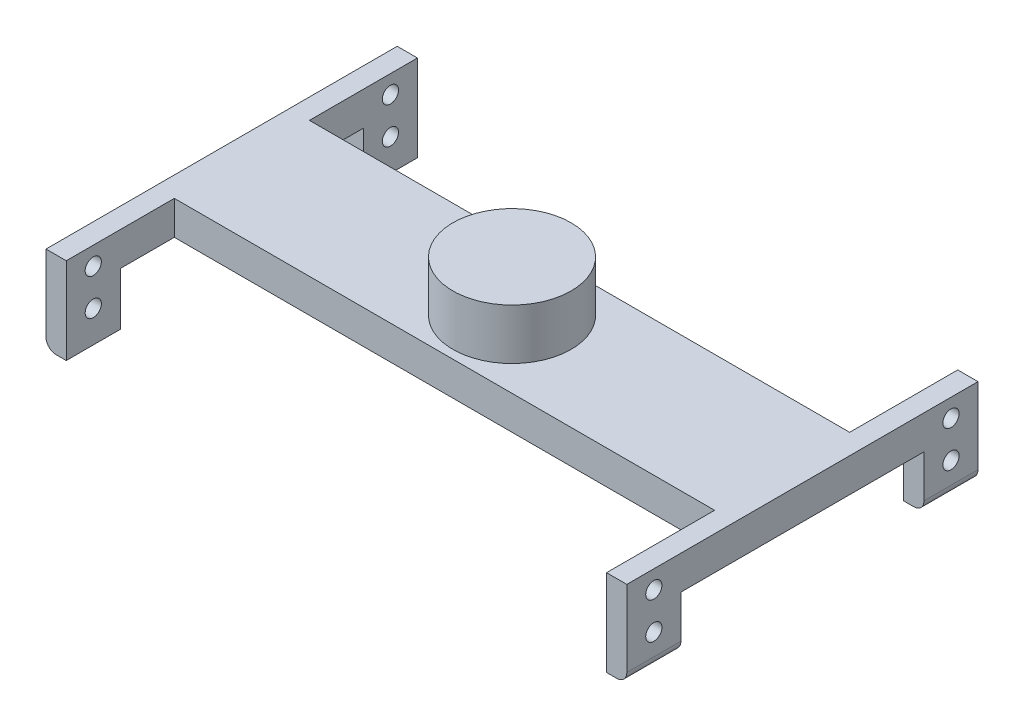
ISO-10303-21;
HEADER;
FILE_DESCRIPTION(('STEP AP214'),'2;1');
FILE_NAME('part.step','',(''),(''),'','','');
FILE_SCHEMA(('AUTOMOTIVE_DESIGN { 1 0 10303 214 1 1 1 1 }'));
ENDSEC;
DATA;
#1=APPLICATION_CONTEXT('core data for automotive mechanical design processes');
#2=APPLICATION_PROTOCOL_DEFINITION('international standard','automotive_design',2000,#1);
#3=PRODUCT_CONTEXT('',#1,'mechanical');
#4=PRODUCT('Part','Part','',(#3));
#5=PRODUCT_RELATED_PRODUCT_CATEGORY('part','',(#4));
#6=PRODUCT_DEFINITION_FORMATION('','',#4);
#7=PRODUCT_DEFINITION_CONTEXT('part definition',#1,'design');
#8=PRODUCT_DEFINITION('design','',#6,#7);
#9=PRODUCT_DEFINITION_SHAPE('','',#8);
#10=(LENGTH_UNIT() NAMED_UNIT(*) SI_UNIT(.MILLI.,.METRE.));
#11=(NAMED_UNIT(*) PLANE_ANGLE_UNIT() SI_UNIT($,.RADIAN.));
#12=(NAMED_UNIT(*) SI_UNIT($,.STERADIAN.) SOLID_ANGLE_UNIT());
#13=UNCERTAINTY_MEASURE_WITH_UNIT(LENGTH_MEASURE(1.E-05),#10,'distance_accuracy_value','');
#14=(GEOMETRIC_REPRESENTATION_CONTEXT(3) GLOBAL_UNCERTAINTY_ASSIGNED_CONTEXT((#13)) GLOBAL_UNIT_ASSIGNED_CONTEXT((#10,
#11,#12)) REPRESENTATION_CONTEXT('',''));
#15=CARTESIAN_POINT('',(0.,0.,0.));
#16=DIRECTION('',(0.,0.,1.));
#17=DIRECTION('',(1.,0.,0.));
#18=AXIS2_PLACEMENT_3D('',#15,#16,#17);
#19=CARTESIAN_POINT('',(-40.,-2.5,10.));
#20=DIRECTION('',(0.,0.,1.));
#21=DIRECTION('',(1.,0.,0.));
#22=AXIS2_PLACEMENT_3D('',#19,#20,#21);
#23=PLANE('',#22);
#24=DIRECTION('',(0.,1.,0.));
#25=VECTOR('',#24,1.);
#26=CARTESIAN_POINT('',(40.,-2.5,10.));
#27=LINE('',#26,#25);
#28=CARTESIAN_POINT('',(40.,-2.5,10.));
#29=VERTEX_POINT('',#28);
#30=CARTESIAN_POINT('',(40.,2.5,10.));
#31=VERTEX_POINT('',#30);
#32=EDGE_CURVE('E341',#29,#31,#27,.T.);
#33=ORIENTED_EDGE('',*,*,#32,.T.);
#34=DIRECTION('',(1.,0.,0.));
#35=VECTOR('',#34,1.);
#36=CARTESIAN_POINT('',(-40.,2.5,10.));
#37=LINE('',#36,#35);
#38=CARTESIAN_POINT('',(-40.,2.49999999999998,10.));
#39=VERTEX_POINT('',#38);
#40=EDGE_CURVE('E331',#39,#31,#37,.T.);
#41=ORIENTED_EDGE('',*,*,#40,.F.);
#42=DIRECTION('',(0.,1.,0.));
#43=VECTOR('',#42,1.);
#44=CARTESIAN_POINT('',(-40.,-2.5,10.));
#45=LINE('',#44,#43);
#46=CARTESIAN_POINT('',(-40.,-2.5,10.));
#47=VERTEX_POINT('',#46);
#48=EDGE_CURVE('E345',#47,#39,#45,.T.);
#49=ORIENTED_EDGE('',*,*,#48,.F.);
#50=DIRECTION('',(1.,0.,0.));
#51=VECTOR('',#50,1.);
#52=CARTESIAN_POINT('',(-40.,-2.5,10.));
#53=LINE('',#52,#51);
#54=EDGE_CURVE('E337',#47,#29,#53,.T.);
#55=ORIENTED_EDGE('',*,*,#54,.T.);
#56=EDGE_LOOP('',(#33,#41,#49,#55));
#57=FACE_BOUND('',#56,.T.);
#58=ADVANCED_FACE('F33',(#57),#23,.T.);
#59=CARTESIAN_POINT('',(-40.,-2.5,-10.));
#60=DIRECTION('',(0.,0.,-1.));
#61=DIRECTION('',(-1.,0.,0.));
#62=AXIS2_PLACEMENT_3D('',#59,#60,#61);
#63=PLANE('',#62);
#64=DIRECTION('',(0.,1.,0.));
#65=VECTOR('',#64,1.);
#66=CARTESIAN_POINT('',(-40.,-2.5,-10.));
#67=LINE('',#66,#65);
#68=CARTESIAN_POINT('',(-40.,-2.5,-10.));
#69=VERTEX_POINT('',#68);
#70=CARTESIAN_POINT('',(-40.,2.5,-10.));
#71=VERTEX_POINT('',#70);
#72=EDGE_CURVE('E347',#69,#71,#67,.T.);
#73=ORIENTED_EDGE('',*,*,#72,.T.);
#74=DIRECTION('',(-1.,0.,0.));
#75=VECTOR('',#74,1.);
#76=CARTESIAN_POINT('',(-40.,2.5,-10.));
#77=LINE('',#76,#75);
#78=CARTESIAN_POINT('',(40.,2.49999999999998,-10.));
#79=VERTEX_POINT('',#78);
#80=EDGE_CURVE('E328',#79,#71,#77,.T.);
#81=ORIENTED_EDGE('',*,*,#80,.F.);
#82=DIRECTION('',(0.,1.,0.));
#83=VECTOR('',#82,1.);
#84=CARTESIAN_POINT('',(40.,-2.5,-10.));
#85=LINE('',#84,#83);
#86=CARTESIAN_POINT('',(40.,-2.5,-10.));
#87=VERTEX_POINT('',#86);
#88=EDGE_CURVE('E340',#87,#79,#85,.T.);
#89=ORIENTED_EDGE('',*,*,#88,.F.);
#90=DIRECTION('',(-1.,0.,0.));
#91=VECTOR('',#90,1.);
#92=CARTESIAN_POINT('',(-40.,-2.5,-10.));
#93=LINE('',#92,#91);
#94=EDGE_CURVE('E334',#87,#69,#93,.T.);
#95=ORIENTED_EDGE('',*,*,#94,.T.);
#96=EDGE_LOOP('',(#73,#81,#89,#95));
#97=FACE_BOUND('',#96,.T.);
#98=ADVANCED_FACE('F492',(#97),#63,.T.);
#99=CARTESIAN_POINT('',(0.,-2.5,0.));
#100=DIRECTION('',(0.,-1.,0.));
#101=DIRECTION('',(0.,0.,-1.));
#102=AXIS2_PLACEMENT_3D('',#99,#100,#101);
#103=PLANE('',#102);
#104=ORIENTED_EDGE('',*,*,#94,.F.);
#105=DIRECTION('',(0.,0.,-1.));
#106=VECTOR('',#105,1.);
#107=CARTESIAN_POINT('',(40.,-2.5,-18.));
#108=LINE('',#107,#106);
#109=CARTESIAN_POINT('',(40.,-2.5,-18.));
#110=VERTEX_POINT('',#109);
#111=EDGE_CURVE('E300',#87,#110,#108,.T.);
#112=ORIENTED_EDGE('',*,*,#111,.T.);
#113=DIRECTION('',(-1.,0.,0.));
#114=VECTOR('',#113,1.);
#115=CARTESIAN_POINT('',(43.,-2.5,-18.));
#116=LINE('',#115,#114);
#117=CARTESIAN_POINT('',(43.,-2.5,-18.));
#118=VERTEX_POINT('',#117);
#119=EDGE_CURVE('E312',#118,#110,#116,.T.);
#120=ORIENTED_EDGE('',*,*,#119,.F.);
#121=DIRECTION('',(0.,0.,-1.));
#122=VECTOR('',#121,1.);
#123=CARTESIAN_POINT('',(43.,-2.5,-18.));
#124=LINE('',#123,#122);
#125=CARTESIAN_POINT('',(43.,-2.5,18.));
#126=VERTEX_POINT('',#125);
#127=EDGE_CURVE('E280',#126,#118,#124,.T.);
#128=ORIENTED_EDGE('',*,*,#127,.F.);
#129=DIRECTION('',(-1.,0.,0.));
#130=VECTOR('',#129,1.);
#131=CARTESIAN_POINT('',(43.,-2.5,18.));
#132=LINE('',#131,#130);
#133=CARTESIAN_POINT('',(40.,-2.5,18.));
#134=VERTEX_POINT('',#133);
#135=EDGE_CURVE('E315',#126,#134,#132,.T.);
#136=ORIENTED_EDGE('',*,*,#135,.T.);
#137=EDGE_CURVE('E301',#134,#29,#108,.T.);
#138=ORIENTED_EDGE('',*,*,#137,.T.);
#139=ORIENTED_EDGE('',*,*,#54,.F.);
#140=DIRECTION('',(0.,0.,-1.));
#141=VECTOR('',#140,1.);
#142=CARTESIAN_POINT('',(-40.,-2.5,-18.));
#143=LINE('',#142,#141);
#144=CARTESIAN_POINT('',(-40.,-2.5,18.));
#145=VERTEX_POINT('',#144);
#146=EDGE_CURVE('E243',#145,#47,#143,.T.);
#147=ORIENTED_EDGE('',*,*,#146,.F.);
#148=DIRECTION('',(1.,0.,0.));
#149=VECTOR('',#148,1.);
#150=CARTESIAN_POINT('',(-43.,-2.5,18.));
#151=LINE('',#150,#149);
#152=CARTESIAN_POINT('',(-43.,-2.5,18.));
#153=VERTEX_POINT('',#152);
#154=EDGE_CURVE('E206',#153,#145,#151,.T.);
#155=ORIENTED_EDGE('',*,*,#154,.F.);
#156=DIRECTION('',(0.,0.,-1.));
#157=VECTOR('',#156,1.);
#158=CARTESIAN_POINT('',(-43.,-2.5,-18.));
#159=LINE('',#158,#157);
#160=CARTESIAN_POINT('',(-43.,-2.5,-18.));
#161=VERTEX_POINT('',#160);
#162=EDGE_CURVE('E212',#153,#161,#159,.T.);
#163=ORIENTED_EDGE('',*,*,#162,.T.);
#164=DIRECTION('',(1.,0.,0.));
#165=VECTOR('',#164,1.);
#166=CARTESIAN_POINT('',(-43.,-2.5,-18.));
#167=LINE('',#166,#165);
#168=CARTESIAN_POINT('',(-40.,-2.5,-18.));
#169=VERTEX_POINT('',#168);
#170=EDGE_CURVE('E195',#161,#169,#167,.T.);
#171=ORIENTED_EDGE('',*,*,#170,.T.);
#172=EDGE_CURVE('E242',#69,#169,#143,.T.);
#173=ORIENTED_EDGE('',*,*,#172,.F.);
#174=EDGE_LOOP('',(#104,#112,#120,#128,#136,#138,#139,#147,#155,#163,#171,#173));
#175=FACE_BOUND('',#174,.T.);
#176=ADVANCED_FACE('F220',(#175),#103,.T.);
#177=CARTESIAN_POINT('',(0.,2.5,0.));
#178=DIRECTION('',(0.,-1.,0.));
#179=DIRECTION('',(0.,0.,-1.));
#180=AXIS2_PLACEMENT_3D('',#177,#178,#179);
#181=PLANE('',#180);
#182=CARTESIAN_POINT('',(0.,2.5,0.));
#183=DIRECTION('',(0.,-1.,0.));
#184=DIRECTION('',(0.,0.,-1.));
#185=AXIS2_PLACEMENT_3D('',#182,#183,#184);
#186=CIRCLE('',#185,8.75);
#187=CARTESIAN_POINT('',(0.,2.5,-8.75));
#188=VERTEX_POINT('',#187);
#189=EDGE_CURVE('E571',#188,#188,#186,.T.);
#190=ORIENTED_EDGE('',*,*,#189,.T.);
#191=EDGE_LOOP('',(#190));
#192=FACE_BOUND('',#191,.T.);
#193=ORIENTED_EDGE('',*,*,#40,.T.);
#194=DIRECTION('',(0.,0.,1.));
#195=VECTOR('',#194,1.);
#196=CARTESIAN_POINT('',(40.,2.49999999999998,26.));
#197=LINE('',#196,#195);
#198=CARTESIAN_POINT('',(40.,2.49999999999998,26.));
#199=VERTEX_POINT('',#198);
#200=EDGE_CURVE('E288',#31,#199,#197,.T.);
#201=ORIENTED_EDGE('',*,*,#200,.T.);
#202=DIRECTION('',(-1.,0.,0.));
#203=VECTOR('',#202,1.);
#204=CARTESIAN_POINT('',(43.,2.49999999999998,26.));
#205=LINE('',#204,#203);
#206=CARTESIAN_POINT('',(43.,2.49999999999998,26.));
#207=VERTEX_POINT('',#206);
#208=EDGE_CURVE('E322',#207,#199,#205,.T.);
#209=ORIENTED_EDGE('',*,*,#208,.F.);
#210=DIRECTION('',(0.,0.,1.));
#211=VECTOR('',#210,1.);
#212=CARTESIAN_POINT('',(43.,2.49999999999998,26.));
#213=LINE('',#212,#211);
#214=CARTESIAN_POINT('',(43.,2.49999999999999,-26.));
#215=VERTEX_POINT('',#214);
#216=EDGE_CURVE('E272',#215,#207,#213,.T.);
#217=ORIENTED_EDGE('',*,*,#216,.F.);
#218=DIRECTION('',(-1.,0.,0.));
#219=VECTOR('',#218,1.);
#220=CARTESIAN_POINT('',(43.,2.49999999999999,-26.));
#221=LINE('',#220,#219);
#222=CARTESIAN_POINT('',(40.,2.49999999999999,-26.));
#223=VERTEX_POINT('',#222);
#224=EDGE_CURVE('E325',#215,#223,#221,.T.);
#225=ORIENTED_EDGE('',*,*,#224,.T.);
#226=EDGE_CURVE('E289',#223,#79,#197,.T.);
#227=ORIENTED_EDGE('',*,*,#226,.T.);
#228=ORIENTED_EDGE('',*,*,#80,.T.);
#229=DIRECTION('',(0.,0.,1.));
#230=VECTOR('',#229,1.);
#231=CARTESIAN_POINT('',(-40.,2.49999999999998,26.));
#232=LINE('',#231,#230);
#233=CARTESIAN_POINT('',(-40.,2.49999999999999,-26.));
#234=VERTEX_POINT('',#233);
#235=EDGE_CURVE('E255',#234,#71,#232,.T.);
#236=ORIENTED_EDGE('',*,*,#235,.F.);
#237=DIRECTION('',(1.,0.,0.));
#238=VECTOR('',#237,1.);
#239=CARTESIAN_POINT('',(-43.,2.49999999999999,-26.));
#240=LINE('',#239,#238);
#241=CARTESIAN_POINT('',(-43.,2.49999999999999,-26.));
#242=VERTEX_POINT('',#241);
#243=EDGE_CURVE('E233',#242,#234,#240,.T.);
#244=ORIENTED_EDGE('',*,*,#243,.F.);
#245=DIRECTION('',(0.,0.,1.));
#246=VECTOR('',#245,1.);
#247=CARTESIAN_POINT('',(-43.,2.49999999999998,26.));
#248=LINE('',#247,#246);
#249=CARTESIAN_POINT('',(-43.,2.49999999999998,26.));
#250=VERTEX_POINT('',#249);
#251=EDGE_CURVE('E230',#242,#250,#248,.T.);
#252=ORIENTED_EDGE('',*,*,#251,.T.);
#253=DIRECTION('',(1.,0.,0.));
#254=VECTOR('',#253,1.);
#255=CARTESIAN_POINT('',(-43.,2.49999999999998,26.));
#256=LINE('',#255,#254);
#257=CARTESIAN_POINT('',(-40.,2.49999999999998,26.));
#258=VERTEX_POINT('',#257);
#259=EDGE_CURVE('E258',#250,#258,#256,.T.);
#260=ORIENTED_EDGE('',*,*,#259,.T.);
#261=EDGE_CURVE('E254',#39,#258,#232,.T.);
#262=ORIENTED_EDGE('',*,*,#261,.F.);
#263=EDGE_LOOP('',(#193,#201,#209,#217,#225,#227,#228,#236,#244,#252,#260,#262));
#264=FACE_BOUND('',#263,.T.);
#265=ADVANCED_FACE('F433',(#192,#264),#181,.F.);
#266=CARTESIAN_POINT('',(40.,0.,0.));
#267=DIRECTION('',(-1.,0.,0.));
#268=DIRECTION('',(0.,0.,1.));
#269=AXIS2_PLACEMENT_3D('',#266,#267,#268);
#270=PLANE('',#269);
#271=CARTESIAN_POINT('',(40.,-5.60000000000002,22.));
#272=DIRECTION('',(-1.,0.,0.));
#273=DIRECTION('',(0.,0.,1.));
#274=AXIS2_PLACEMENT_3D('',#271,#272,#273);
#275=CIRCLE('',#274,1.2);
#276=CARTESIAN_POINT('',(40.,-5.60000000000002,23.2));
#277=VERTEX_POINT('',#276);
#278=EDGE_CURVE('E406',#277,#277,#275,.T.);
#279=ORIENTED_EDGE('',*,*,#278,.F.);
#280=EDGE_LOOP('',(#279));
#281=FACE_BOUND('',#280,.T.);
#282=CARTESIAN_POINT('',(40.,-0.200000000000023,22.));
#283=DIRECTION('',(-1.,0.,0.));
#284=DIRECTION('',(0.,0.,1.));
#285=AXIS2_PLACEMENT_3D('',#282,#283,#284);
#286=CIRCLE('',#285,1.2);
#287=CARTESIAN_POINT('',(40.,-0.200000000000023,23.2));
#288=VERTEX_POINT('',#287);
#289=EDGE_CURVE('E387',#288,#288,#286,.T.);
#290=ORIENTED_EDGE('',*,*,#289,.F.);
#291=EDGE_LOOP('',(#290));
#292=FACE_BOUND('',#291,.T.);
#293=ORIENTED_EDGE('',*,*,#32,.F.);
#294=ORIENTED_EDGE('',*,*,#137,.F.);
#295=DIRECTION('',(0.,1.,0.));
#296=VECTOR('',#295,1.);
#297=CARTESIAN_POINT('',(40.,-10.3,18.));
#298=LINE('',#297,#296);
#299=CARTESIAN_POINT('',(40.,-10.3,18.));
#300=VERTEX_POINT('',#299);
#301=EDGE_CURVE('E298',#300,#134,#298,.T.);
#302=ORIENTED_EDGE('',*,*,#301,.F.);
#303=DIRECTION('',(0.,0.,-1.));
#304=VECTOR('',#303,1.);
#305=CARTESIAN_POINT('',(40.,-10.3,26.));
#306=LINE('',#305,#304);
#307=CARTESIAN_POINT('',(40.,-10.3,26.));
#308=VERTEX_POINT('',#307);
#309=EDGE_CURVE('E295',#308,#300,#306,.T.);
#310=ORIENTED_EDGE('',*,*,#309,.F.);
#311=DIRECTION('',(0.,-1.,0.));
#312=VECTOR('',#311,1.);
#313=CARTESIAN_POINT('',(40.,2.49999999999998,26.));
#314=LINE('',#313,#312);
#315=EDGE_CURVE('E292',#199,#308,#314,.T.);
#316=ORIENTED_EDGE('',*,*,#315,.F.);
#317=ORIENTED_EDGE('',*,*,#200,.F.);
#318=EDGE_LOOP('',(#293,#294,#302,#310,#316,#317));
#319=FACE_BOUND('',#318,.T.);
#320=ADVANCED_FACE('F460',(#281,#292,#319),#270,.T.);
#321=CARTESIAN_POINT('',(43.,2.49999999999999,-26.));
#322=DIRECTION('',(0.,0.,1.));
#323=DIRECTION('',(0.,-1.,0.));
#324=AXIS2_PLACEMENT_3D('',#321,#322,#323);
#325=PLANE('',#324);
#326=DIRECTION('',(0.,1.,0.));
#327=VECTOR('',#326,1.);
#328=CARTESIAN_POINT('',(43.,2.49999999999999,-26.));
#329=LINE('',#328,#327);
#330=CARTESIAN_POINT('',(43.,-8.80000000000001,-26.));
#331=VERTEX_POINT('',#330);
#332=EDGE_CURVE('E270',#331,#215,#329,.T.);
#333=ORIENTED_EDGE('',*,*,#332,.F.);
#334=CARTESIAN_POINT('',(41.5,-8.80000000000001,-26.));
#335=DIRECTION('',(0.,0.,1.));
#336=DIRECTION('',(0.,-1.,0.));
#337=AXIS2_PLACEMENT_3D('',#334,#335,#336);
#338=CIRCLE('',#337,1.5);
#339=CARTESIAN_POINT('',(41.5,-10.3,-26.));
#340=VERTEX_POINT('',#339);
#341=EDGE_CURVE('E57',#331,#340,#338,.F.);
#342=ORIENTED_EDGE('',*,*,#341,.T.);
#343=DIRECTION('',(-1.,0.,0.));
#344=VECTOR('',#343,1.);
#345=CARTESIAN_POINT('',(43.,-10.3,-26.));
#346=LINE('',#345,#344);
#347=CARTESIAN_POINT('',(40.,-10.3,-26.));
#348=VERTEX_POINT('',#347);
#349=EDGE_CURVE('E285',#340,#348,#346,.T.);
#350=ORIENTED_EDGE('',*,*,#349,.T.);
#351=DIRECTION('',(0.,1.,0.));
#352=VECTOR('',#351,1.);
#353=CARTESIAN_POINT('',(40.,2.49999999999999,-26.));
#354=LINE('',#353,#352);
#355=EDGE_CURVE('E269',#348,#223,#354,.T.);
#356=ORIENTED_EDGE('',*,*,#355,.T.);
#357=ORIENTED_EDGE('',*,*,#224,.F.);
#358=EDGE_LOOP('',(#333,#342,#350,#356,#357));
#359=FACE_BOUND('',#358,.T.);
#360=ADVANCED_FACE('F483',(#359),#325,.F.);
#361=CARTESIAN_POINT('',(43.,2.49999999999998,26.));
#362=DIRECTION('',(0.,0.,-1.));
#363=DIRECTION('',(0.,1.,0.));
#364=AXIS2_PLACEMENT_3D('',#361,#362,#363);
#365=PLANE('',#364);
#366=DIRECTION('',(-1.,0.,0.));
#367=VECTOR('',#366,1.);
#368=CARTESIAN_POINT('',(43.,-10.3,26.));
#369=LINE('',#368,#367);
#370=CARTESIAN_POINT('',(41.5,-10.3,26.));
#371=VERTEX_POINT('',#370);
#372=EDGE_CURVE('E320',#371,#308,#369,.T.);
#373=ORIENTED_EDGE('',*,*,#372,.F.);
#374=CARTESIAN_POINT('',(41.5,-8.80000000000002,26.));
#375=DIRECTION('',(0.,0.,-1.));
#376=DIRECTION('',(0.,1.,0.));
#377=AXIS2_PLACEMENT_3D('',#374,#375,#376);
#378=CIRCLE('',#377,1.5);
#379=CARTESIAN_POINT('',(43.,-8.80000000000002,26.));
#380=VERTEX_POINT('',#379);
#381=EDGE_CURVE('E377',#371,#380,#378,.F.);
#382=ORIENTED_EDGE('',*,*,#381,.T.);
#383=DIRECTION('',(0.,-1.,0.));
#384=VECTOR('',#383,1.);
#385=CARTESIAN_POINT('',(43.,2.49999999999998,26.));
#386=LINE('',#385,#384);
#387=EDGE_CURVE('E275',#207,#380,#386,.T.);
#388=ORIENTED_EDGE('',*,*,#387,.F.);
#389=ORIENTED_EDGE('',*,*,#208,.T.);
#390=ORIENTED_EDGE('',*,*,#315,.T.);
#391=EDGE_LOOP('',(#373,#382,#388,#389,#390));
#392=FACE_BOUND('',#391,.T.);
#393=ADVANCED_FACE('F477',(#392),#365,.F.);
#394=CARTESIAN_POINT('',(43.,-10.3,26.));
#395=DIRECTION('',(0.,1.,0.));
#396=DIRECTION('',(0.,0.,1.));
#397=AXIS2_PLACEMENT_3D('',#394,#395,#396);
#398=PLANE('',#397);
#399=DIRECTION('',(-1.,0.,0.));
#400=VECTOR('',#399,1.);
#401=CARTESIAN_POINT('',(43.,-10.3,18.));
#402=LINE('',#401,#400);
#403=CARTESIAN_POINT('',(41.5,-10.3,18.));
#404=VERTEX_POINT('',#403);
#405=EDGE_CURVE('E318',#404,#300,#402,.T.);
#406=ORIENTED_EDGE('',*,*,#405,.F.);
#407=DIRECTION('',(0.,0.,-1.));
#408=VECTOR('',#407,1.);
#409=CARTESIAN_POINT('',(41.5,-10.3,26.));
#410=LINE('',#409,#408);
#411=EDGE_CURVE('E375',#404,#371,#410,.F.);
#412=ORIENTED_EDGE('',*,*,#411,.T.);
#413=ORIENTED_EDGE('',*,*,#372,.T.);
#414=ORIENTED_EDGE('',*,*,#309,.T.);
#415=EDGE_LOOP('',(#406,#412,#413,#414));
#416=FACE_BOUND('',#415,.T.);
#417=ADVANCED_FACE('F472',(#416),#398,.F.);
#418=CARTESIAN_POINT('',(43.,-10.3,18.));
#419=DIRECTION('',(0.,0.,1.));
#420=DIRECTION('',(1.,0.,0.));
#421=AXIS2_PLACEMENT_3D('',#418,#419,#420);
#422=PLANE('',#421);
#423=DIRECTION('',(0.,1.,0.));
#424=VECTOR('',#423,1.);
#425=CARTESIAN_POINT('',(43.,-10.3,18.));
#426=LINE('',#425,#424);
#427=CARTESIAN_POINT('',(43.,-8.80000000000002,18.));
#428=VERTEX_POINT('',#427);
#429=EDGE_CURVE('E278',#428,#126,#426,.T.);
#430=ORIENTED_EDGE('',*,*,#429,.F.);
#431=CARTESIAN_POINT('',(41.5,-8.80000000000002,18.));
#432=DIRECTION('',(0.,0.,1.));
#433=DIRECTION('',(1.,0.,0.));
#434=AXIS2_PLACEMENT_3D('',#431,#432,#433);
#435=CIRCLE('',#434,1.5);
#436=EDGE_CURVE('E373',#428,#404,#435,.F.);
#437=ORIENTED_EDGE('',*,*,#436,.T.);
#438=ORIENTED_EDGE('',*,*,#405,.T.);
#439=ORIENTED_EDGE('',*,*,#301,.T.);
#440=ORIENTED_EDGE('',*,*,#135,.F.);
#441=EDGE_LOOP('',(#430,#437,#438,#439,#440));
#442=FACE_BOUND('',#441,.T.);
#443=ADVANCED_FACE('F468',(#442),#422,.F.);
#444=CARTESIAN_POINT('',(43.,-10.3,-18.));
#445=DIRECTION('',(0.,0.,-1.));
#446=DIRECTION('',(-1.,0.,0.));
#447=AXIS2_PLACEMENT_3D('',#444,#445,#446);
#448=PLANE('',#447);
#449=DIRECTION('',(-1.,0.,0.));
#450=VECTOR('',#449,1.);
#451=CARTESIAN_POINT('',(43.,-10.3,-18.));
#452=LINE('',#451,#450);
#453=CARTESIAN_POINT('',(41.5,-10.3,-18.));
#454=VERTEX_POINT('',#453);
#455=CARTESIAN_POINT('',(40.,-10.3,-18.));
#456=VERTEX_POINT('',#455);
#457=EDGE_CURVE('E310',#454,#456,#452,.T.);
#458=ORIENTED_EDGE('',*,*,#457,.F.);
#459=CARTESIAN_POINT('',(41.5,-8.80000000000001,-18.));
#460=DIRECTION('',(0.,0.,-1.));
#461=DIRECTION('',(-1.,0.,0.));
#462=AXIS2_PLACEMENT_3D('',#459,#460,#461);
#463=CIRCLE('',#462,1.5);
#464=CARTESIAN_POINT('',(43.,-8.80000000000001,-18.));
#465=VERTEX_POINT('',#464);
#466=EDGE_CURVE('E11',#454,#465,#463,.F.);
#467=ORIENTED_EDGE('',*,*,#466,.T.);
#468=DIRECTION('',(0.,-1.,0.));
#469=VECTOR('',#468,1.);
#470=CARTESIAN_POINT('',(43.,-10.3,-18.));
#471=LINE('',#470,#469);
#472=EDGE_CURVE('E282',#118,#465,#471,.T.);
#473=ORIENTED_EDGE('',*,*,#472,.F.);
#474=ORIENTED_EDGE('',*,*,#119,.T.);
#475=DIRECTION('',(0.,-1.,0.));
#476=VECTOR('',#475,1.);
#477=CARTESIAN_POINT('',(40.,-10.3,-18.));
#478=LINE('',#477,#476);
#479=EDGE_CURVE('E304',#110,#456,#478,.T.);
#480=ORIENTED_EDGE('',*,*,#479,.T.);
#481=EDGE_LOOP('',(#458,#467,#473,#474,#480));
#482=FACE_BOUND('',#481,.T.);
#483=ADVANCED_FACE('F497',(#482),#448,.F.);
#484=CARTESIAN_POINT('',(43.,-10.3,-26.));
#485=DIRECTION('',(0.,1.,0.));
#486=DIRECTION('',(0.,0.,1.));
#487=AXIS2_PLACEMENT_3D('',#484,#485,#486);
#488=PLANE('',#487);
#489=ORIENTED_EDGE('',*,*,#349,.F.);
#490=DIRECTION('',(0.,0.,-1.));
#491=VECTOR('',#490,1.);
#492=CARTESIAN_POINT('',(41.5,-10.3,-26.));
#493=LINE('',#492,#491);
#494=EDGE_CURVE('E42',#340,#454,#493,.F.);
#495=ORIENTED_EDGE('',*,*,#494,.T.);
#496=ORIENTED_EDGE('',*,*,#457,.T.);
#497=DIRECTION('',(0.,0.,-1.));
#498=VECTOR('',#497,1.);
#499=CARTESIAN_POINT('',(40.,-10.3,-26.));
#500=LINE('',#499,#498);
#501=EDGE_CURVE('E273',#456,#348,#500,.T.);
#502=ORIENTED_EDGE('',*,*,#501,.T.);
#503=EDGE_LOOP('',(#489,#495,#496,#502));
#504=FACE_BOUND('',#503,.T.);
#505=ADVANCED_FACE('F546',(#504),#488,.F.);
#506=CARTESIAN_POINT('',(43.,0.,0.));
#507=DIRECTION('',(-1.,0.,0.));
#508=DIRECTION('',(0.,0.,1.));
#509=AXIS2_PLACEMENT_3D('',#506,#507,#508);
#510=PLANE('',#509);
#511=CARTESIAN_POINT('',(43.,-5.60000000000002,-22.));
#512=DIRECTION('',(-1.,0.,0.));
#513=DIRECTION('',(0.,0.,1.));
#514=AXIS2_PLACEMENT_3D('',#511,#512,#513);
#515=CIRCLE('',#514,1.2);
#516=CARTESIAN_POINT('',(43.,-5.60000000000002,-20.8));
#517=VERTEX_POINT('',#516);
#518=EDGE_CURVE('E238',#517,#517,#515,.T.);
#519=ORIENTED_EDGE('',*,*,#518,.T.);
#520=EDGE_LOOP('',(#519));
#521=FACE_BOUND('',#520,.T.);
#522=CARTESIAN_POINT('',(43.,-5.60000000000002,22.));
#523=DIRECTION('',(-1.,0.,0.));
#524=DIRECTION('',(0.,0.,1.));
#525=AXIS2_PLACEMENT_3D('',#522,#523,#524);
#526=CIRCLE('',#525,1.2);
#527=CARTESIAN_POINT('',(43.,-5.60000000000002,23.2));
#528=VERTEX_POINT('',#527);
#529=EDGE_CURVE('E403',#528,#528,#526,.T.);
#530=ORIENTED_EDGE('',*,*,#529,.T.);
#531=EDGE_LOOP('',(#530));
#532=FACE_BOUND('',#531,.T.);
#533=CARTESIAN_POINT('',(43.,-0.200000000000023,22.));
#534=DIRECTION('',(-1.,0.,0.));
#535=DIRECTION('',(0.,0.,1.));
#536=AXIS2_PLACEMENT_3D('',#533,#534,#535);
#537=CIRCLE('',#536,1.2);
#538=CARTESIAN_POINT('',(43.,-0.200000000000023,23.2));
#539=VERTEX_POINT('',#538);
#540=EDGE_CURVE('E382',#539,#539,#537,.T.);
#541=ORIENTED_EDGE('',*,*,#540,.T.);
#542=EDGE_LOOP('',(#541));
#543=FACE_BOUND('',#542,.T.);
#544=CARTESIAN_POINT('',(43.,-0.200000000000023,-22.));
#545=DIRECTION('',(-1.,0.,0.));
#546=DIRECTION('',(0.,0.,1.));
#547=AXIS2_PLACEMENT_3D('',#544,#545,#546);
#548=CIRCLE('',#547,1.2);
#549=CARTESIAN_POINT('',(43.,-0.200000000000023,-20.8));
#550=VERTEX_POINT('',#549);
#551=EDGE_CURVE('E415',#550,#550,#548,.T.);
#552=ORIENTED_EDGE('',*,*,#551,.T.);
#553=EDGE_LOOP('',(#552));
#554=FACE_BOUND('',#553,.T.);
#555=ORIENTED_EDGE('',*,*,#387,.T.);
#556=DIRECTION('',(0.,0.,-1.));
#557=VECTOR('',#556,1.);
#558=CARTESIAN_POINT('',(43.,-8.80000000000002,0.));
#559=LINE('',#558,#557);
#560=EDGE_CURVE('E370',#380,#428,#559,.T.);
#561=ORIENTED_EDGE('',*,*,#560,.T.);
#562=ORIENTED_EDGE('',*,*,#429,.T.);
#563=ORIENTED_EDGE('',*,*,#127,.T.);
#564=ORIENTED_EDGE('',*,*,#472,.T.);
#565=DIRECTION('',(0.,0.,-1.));
#566=VECTOR('',#565,1.);
#567=CARTESIAN_POINT('',(43.,-8.80000000000002,0.));
#568=LINE('',#567,#566);
#569=EDGE_CURVE('E367',#465,#331,#568,.T.);
#570=ORIENTED_EDGE('',*,*,#569,.T.);
#571=ORIENTED_EDGE('',*,*,#332,.T.);
#572=ORIENTED_EDGE('',*,*,#216,.T.);
#573=EDGE_LOOP('',(#555,#561,#562,#563,#564,#570,#571,#572));
#574=FACE_BOUND('',#573,.T.);
#575=ADVANCED_FACE('F500',(#521,#532,#543,#554,#574),#510,.F.);
#576=CARTESIAN_POINT('',(40.,-5.60000000000002,-22.));
#577=DIRECTION('',(-1.,0.,0.));
#578=DIRECTION('',(0.,0.,1.));
#579=AXIS2_PLACEMENT_3D('',#576,#577,#578);
#580=CIRCLE('',#579,1.2);
#581=CARTESIAN_POINT('',(40.,-5.60000000000002,-20.8));
#582=VERTEX_POINT('',#581);
#583=EDGE_CURVE('E421',#582,#582,#580,.T.);
#584=ORIENTED_EDGE('',*,*,#583,.F.);
#585=EDGE_LOOP('',(#584));
#586=FACE_BOUND('',#585,.T.);
#587=CARTESIAN_POINT('',(40.,-0.200000000000023,-22.));
#588=DIRECTION('',(-1.,0.,0.));
#589=DIRECTION('',(0.,0.,1.));
#590=AXIS2_PLACEMENT_3D('',#587,#588,#589);
#591=CIRCLE('',#590,1.2);
#592=CARTESIAN_POINT('',(40.,-0.200000000000023,-20.8));
#593=VERTEX_POINT('',#592);
#594=EDGE_CURVE('E412',#593,#593,#591,.T.);
#595=ORIENTED_EDGE('',*,*,#594,.F.);
#596=EDGE_LOOP('',(#595));
#597=FACE_BOUND('',#596,.T.);
#598=ORIENTED_EDGE('',*,*,#111,.F.);
#599=ORIENTED_EDGE('',*,*,#88,.T.);
#600=ORIENTED_EDGE('',*,*,#226,.F.);
#601=ORIENTED_EDGE('',*,*,#355,.F.);
#602=ORIENTED_EDGE('',*,*,#501,.F.);
#603=ORIENTED_EDGE('',*,*,#479,.F.);
#604=EDGE_LOOP('',(#598,#599,#600,#601,#602,#603));
#605=FACE_BOUND('',#604,.T.);
#606=ADVANCED_FACE('F487',(#586,#597,#605),#270,.T.);
#607=CARTESIAN_POINT('',(-40.,0.,0.));
#608=DIRECTION('',(1.,0.,0.));
#609=DIRECTION('',(0.,0.,1.));
#610=AXIS2_PLACEMENT_3D('',#607,#608,#609);
#611=PLANE('',#610);
#612=CARTESIAN_POINT('',(-40.,-5.60000000000002,-22.));
#613=DIRECTION('',(1.,0.,0.));
#614=DIRECTION('',(0.,0.,-1.));
#615=AXIS2_PLACEMENT_3D('',#612,#613,#614);
#616=CIRCLE('',#615,1.2);
#617=CARTESIAN_POINT('',(-40.,-5.60000000000002,-23.2));
#618=VERTEX_POINT('',#617);
#619=EDGE_CURVE('E418',#618,#618,#616,.T.);
#620=ORIENTED_EDGE('',*,*,#619,.F.);
#621=EDGE_LOOP('',(#620));
#622=FACE_BOUND('',#621,.T.);
#623=CARTESIAN_POINT('',(-40.,-0.200000000000023,-22.));
#624=DIRECTION('',(1.,0.,0.));
#625=DIRECTION('',(0.,0.,-1.));
#626=AXIS2_PLACEMENT_3D('',#623,#624,#625);
#627=CIRCLE('',#626,1.2);
#628=CARTESIAN_POINT('',(-40.,-0.200000000000023,-23.2));
#629=VERTEX_POINT('',#628);
#630=EDGE_CURVE('E409',#629,#629,#627,.T.);
#631=ORIENTED_EDGE('',*,*,#630,.F.);
#632=EDGE_LOOP('',(#631));
#633=FACE_BOUND('',#632,.T.);
#634=ORIENTED_EDGE('',*,*,#72,.F.);
#635=ORIENTED_EDGE('',*,*,#172,.T.);
#636=DIRECTION('',(0.,-1.,0.));
#637=VECTOR('',#636,1.);
#638=CARTESIAN_POINT('',(-40.,-10.3,-18.));
#639=LINE('',#638,#637);
#640=CARTESIAN_POINT('',(-40.,-10.3,-18.));
#641=VERTEX_POINT('',#640);
#642=EDGE_CURVE('E201',#169,#641,#639,.T.);
#643=ORIENTED_EDGE('',*,*,#642,.T.);
#644=DIRECTION('',(0.,0.,-1.));
#645=VECTOR('',#644,1.);
#646=CARTESIAN_POINT('',(-40.,-10.3,-26.));
#647=LINE('',#646,#645);
#648=CARTESIAN_POINT('',(-40.,-10.3,-26.));
#649=VERTEX_POINT('',#648);
#650=EDGE_CURVE('E237',#641,#649,#647,.T.);
#651=ORIENTED_EDGE('',*,*,#650,.T.);
#652=DIRECTION('',(0.,1.,0.));
#653=VECTOR('',#652,1.);
#654=CARTESIAN_POINT('',(-40.,2.49999999999999,-26.));
#655=LINE('',#654,#653);
#656=EDGE_CURVE('E234',#649,#234,#655,.T.);
#657=ORIENTED_EDGE('',*,*,#656,.T.);
#658=ORIENTED_EDGE('',*,*,#235,.T.);
#659=EDGE_LOOP('',(#634,#635,#643,#651,#657,#658));
#660=FACE_BOUND('',#659,.T.);
#661=ADVANCED_FACE('F494',(#622,#633,#660),#611,.T.);
#662=CARTESIAN_POINT('',(-43.,2.49999999999999,-26.));
#663=DIRECTION('',(0.,0.,-1.));
#664=DIRECTION('',(0.,1.,0.));
#665=AXIS2_PLACEMENT_3D('',#662,#663,#664);
#666=PLANE('',#665);
#667=DIRECTION('',(1.,0.,0.));
#668=VECTOR('',#667,1.);
#669=CARTESIAN_POINT('',(-43.,-10.3,-26.));
#670=LINE('',#669,#668);
#671=CARTESIAN_POINT('',(-41.5,-10.3,-26.));
#672=VERTEX_POINT('',#671);
#673=EDGE_CURVE('E267',#672,#649,#670,.T.);
#674=ORIENTED_EDGE('',*,*,#673,.F.);
#675=CARTESIAN_POINT('',(-41.5,-8.80000000000001,-26.));
#676=DIRECTION('',(0.,0.,-1.));
#677=DIRECTION('',(0.,1.,0.));
#678=AXIS2_PLACEMENT_3D('',#675,#676,#677);
#679=CIRCLE('',#678,1.5);
#680=CARTESIAN_POINT('',(-43.,-8.80000000000001,-26.));
#681=VERTEX_POINT('',#680);
#682=EDGE_CURVE('E363',#672,#681,#679,.T.);
#683=ORIENTED_EDGE('',*,*,#682,.T.);
#684=DIRECTION('',(0.,1.,0.));
#685=VECTOR('',#684,1.);
#686=CARTESIAN_POINT('',(-43.,2.49999999999999,-26.));
#687=LINE('',#686,#685);
#688=EDGE_CURVE('E216',#681,#242,#687,.T.);
#689=ORIENTED_EDGE('',*,*,#688,.T.);
#690=ORIENTED_EDGE('',*,*,#243,.T.);
#691=ORIENTED_EDGE('',*,*,#656,.F.);
#692=EDGE_LOOP('',(#674,#683,#689,#690,#691));
#693=FACE_BOUND('',#692,.T.);
#694=ADVANCED_FACE('F428',(#693),#666,.T.);
#695=CARTESIAN_POINT('',(-43.,-10.3,-26.));
#696=DIRECTION('',(0.,-1.,0.));
#697=DIRECTION('',(0.,0.,-1.));
#698=AXIS2_PLACEMENT_3D('',#695,#696,#697);
#699=PLANE('',#698);
#700=DIRECTION('',(1.,0.,0.));
#701=VECTOR('',#700,1.);
#702=CARTESIAN_POINT('',(-43.,-10.3,-18.));
#703=LINE('',#702,#701);
#704=CARTESIAN_POINT('',(-41.5,-10.3,-18.));
#705=VERTEX_POINT('',#704);
#706=EDGE_CURVE('E205',#705,#641,#703,.T.);
#707=ORIENTED_EDGE('',*,*,#706,.F.);
#708=DIRECTION('',(0.,0.,-1.));
#709=VECTOR('',#708,1.);
#710=CARTESIAN_POINT('',(-41.5,-10.3,-26.));
#711=LINE('',#710,#709);
#712=EDGE_CURVE('E360',#705,#672,#711,.T.);
#713=ORIENTED_EDGE('',*,*,#712,.T.);
#714=ORIENTED_EDGE('',*,*,#673,.T.);
#715=ORIENTED_EDGE('',*,*,#650,.F.);
#716=EDGE_LOOP('',(#707,#713,#714,#715));
#717=FACE_BOUND('',#716,.T.);
#718=ADVANCED_FACE('F533',(#717),#699,.T.);
#719=CARTESIAN_POINT('',(-43.,-10.3,-18.));
#720=DIRECTION('',(0.,0.,1.));
#721=DIRECTION('',(1.,0.,0.));
#722=AXIS2_PLACEMENT_3D('',#719,#720,#721);
#723=PLANE('',#722);
#724=DIRECTION('',(0.,-1.,0.));
#725=VECTOR('',#724,1.);
#726=CARTESIAN_POINT('',(-43.,-10.3,-18.));
#727=LINE('',#726,#725);
#728=CARTESIAN_POINT('',(-43.,-8.80000000000001,-18.));
#729=VERTEX_POINT('',#728);
#730=EDGE_CURVE('E198',#161,#729,#727,.T.);
#731=ORIENTED_EDGE('',*,*,#730,.T.);
#732=CARTESIAN_POINT('',(-41.5,-8.80000000000001,-18.));
#733=DIRECTION('',(0.,0.,1.));
#734=DIRECTION('',(1.,0.,0.));
#735=AXIS2_PLACEMENT_3D('',#732,#733,#734);
#736=CIRCLE('',#735,1.5);
#737=EDGE_CURVE('E365',#729,#705,#736,.T.);
#738=ORIENTED_EDGE('',*,*,#737,.T.);
#739=ORIENTED_EDGE('',*,*,#706,.T.);
#740=ORIENTED_EDGE('',*,*,#642,.F.);
#741=ORIENTED_EDGE('',*,*,#170,.F.);
#742=EDGE_LOOP('',(#731,#738,#739,#740,#741));
#743=FACE_BOUND('',#742,.T.);
#744=ADVANCED_FACE('F197',(#743),#723,.T.);
#745=CARTESIAN_POINT('',(-43.,-10.3,18.));
#746=DIRECTION('',(0.,0.,-1.));
#747=DIRECTION('',(-1.,0.,0.));
#748=AXIS2_PLACEMENT_3D('',#745,#746,#747);
#749=PLANE('',#748);
#750=DIRECTION('',(1.,0.,0.));
#751=VECTOR('',#750,1.);
#752=CARTESIAN_POINT('',(-43.,-10.3,18.));
#753=LINE('',#752,#751);
#754=CARTESIAN_POINT('',(-41.5,-10.3,18.));
#755=VERTEX_POINT('',#754);
#756=CARTESIAN_POINT('',(-40.,-10.3,18.));
#757=VERTEX_POINT('',#756);
#758=EDGE_CURVE('E263',#755,#757,#753,.T.);
#759=ORIENTED_EDGE('',*,*,#758,.F.);
#760=CARTESIAN_POINT('',(-41.5,-8.80000000000002,18.));
#761=DIRECTION('',(0.,0.,-1.));
#762=DIRECTION('',(-1.,0.,0.));
#763=AXIS2_PLACEMENT_3D('',#760,#761,#762);
#764=CIRCLE('',#763,1.5);
#765=CARTESIAN_POINT('',(-43.,-8.80000000000002,18.));
#766=VERTEX_POINT('',#765);
#767=EDGE_CURVE('E353',#755,#766,#764,.T.);
#768=ORIENTED_EDGE('',*,*,#767,.T.);
#769=DIRECTION('',(0.,1.,0.));
#770=VECTOR('',#769,1.);
#771=CARTESIAN_POINT('',(-43.,-10.3,18.));
#772=LINE('',#771,#770);
#773=EDGE_CURVE('E222',#766,#153,#772,.T.);
#774=ORIENTED_EDGE('',*,*,#773,.T.);
#775=ORIENTED_EDGE('',*,*,#154,.T.);
#776=DIRECTION('',(0.,1.,0.));
#777=VECTOR('',#776,1.);
#778=CARTESIAN_POINT('',(-40.,-10.3,18.));
#779=LINE('',#778,#777);
#780=EDGE_CURVE('E245',#757,#145,#779,.T.);
#781=ORIENTED_EDGE('',*,*,#780,.F.);
#782=EDGE_LOOP('',(#759,#768,#774,#775,#781));
#783=FACE_BOUND('',#782,.T.);
#784=ADVANCED_FACE('F450',(#783),#749,.T.);
#785=CARTESIAN_POINT('',(-43.,-10.3,26.));
#786=DIRECTION('',(0.,-1.,0.));
#787=DIRECTION('',(0.,0.,-1.));
#788=AXIS2_PLACEMENT_3D('',#785,#786,#787);
#789=PLANE('',#788);
#790=DIRECTION('',(1.,0.,0.));
#791=VECTOR('',#790,1.);
#792=CARTESIAN_POINT('',(-43.,-10.3,26.));
#793=LINE('',#792,#791);
#794=CARTESIAN_POINT('',(-41.5,-10.3,26.));
#795=VERTEX_POINT('',#794);
#796=CARTESIAN_POINT('',(-40.,-10.3,26.));
#797=VERTEX_POINT('',#796);
#798=EDGE_CURVE('E261',#795,#797,#793,.T.);
#799=ORIENTED_EDGE('',*,*,#798,.F.);
#800=DIRECTION('',(0.,0.,-1.));
#801=VECTOR('',#800,1.);
#802=CARTESIAN_POINT('',(-41.5,-10.3,18.));
#803=LINE('',#802,#801);
#804=EDGE_CURVE('E344',#795,#755,#803,.T.);
#805=ORIENTED_EDGE('',*,*,#804,.T.);
#806=ORIENTED_EDGE('',*,*,#758,.T.);
#807=DIRECTION('',(0.,0.,-1.));
#808=VECTOR('',#807,1.);
#809=CARTESIAN_POINT('',(-40.,-10.3,26.));
#810=LINE('',#809,#808);
#811=EDGE_CURVE('E248',#797,#757,#810,.T.);
#812=ORIENTED_EDGE('',*,*,#811,.F.);
#813=EDGE_LOOP('',(#799,#805,#806,#812));
#814=FACE_BOUND('',#813,.T.);
#815=ADVANCED_FACE('F446',(#814),#789,.T.);
#816=CARTESIAN_POINT('',(-43.,2.49999999999998,26.));
#817=DIRECTION('',(0.,0.,1.));
#818=DIRECTION('',(0.,-1.,0.));
#819=AXIS2_PLACEMENT_3D('',#816,#817,#818);
#820=PLANE('',#819);
#821=DIRECTION('',(0.,-1.,0.));
#822=VECTOR('',#821,1.);
#823=CARTESIAN_POINT('',(-43.,2.49999999999998,26.));
#824=LINE('',#823,#822);
#825=CARTESIAN_POINT('',(-43.,-8.80000000000002,26.));
#826=VERTEX_POINT('',#825);
#827=EDGE_CURVE('E224',#250,#826,#824,.T.);
#828=ORIENTED_EDGE('',*,*,#827,.T.);
#829=CARTESIAN_POINT('',(-41.5,-8.80000000000002,26.));
#830=DIRECTION('',(0.,0.,1.));
#831=DIRECTION('',(0.,-1.,0.));
#832=AXIS2_PLACEMENT_3D('',#829,#830,#831);
#833=CIRCLE('',#832,1.5);
#834=EDGE_CURVE('E358',#826,#795,#833,.T.);
#835=ORIENTED_EDGE('',*,*,#834,.T.);
#836=ORIENTED_EDGE('',*,*,#798,.T.);
#837=DIRECTION('',(0.,-1.,0.));
#838=VECTOR('',#837,1.);
#839=CARTESIAN_POINT('',(-40.,2.49999999999998,26.));
#840=LINE('',#839,#838);
#841=EDGE_CURVE('E251',#258,#797,#840,.T.);
#842=ORIENTED_EDGE('',*,*,#841,.F.);
#843=ORIENTED_EDGE('',*,*,#259,.F.);
#844=EDGE_LOOP('',(#828,#835,#836,#842,#843));
#845=FACE_BOUND('',#844,.T.);
#846=ADVANCED_FACE('F438',(#845),#820,.T.);
#847=CARTESIAN_POINT('',(-43.,0.,0.));
#848=DIRECTION('',(1.,0.,0.));
#849=DIRECTION('',(0.,0.,1.));
#850=AXIS2_PLACEMENT_3D('',#847,#848,#849);
#851=PLANE('',#850);
#852=CARTESIAN_POINT('',(-43.,-5.60000000000002,-22.));
#853=DIRECTION('',(1.,0.,0.));
#854=DIRECTION('',(0.,0.,-1.));
#855=AXIS2_PLACEMENT_3D('',#852,#853,#854);
#856=CIRCLE('',#855,1.2);
#857=CARTESIAN_POINT('',(-43.,-5.60000000000002,-23.2));
#858=VERTEX_POINT('',#857);
#859=EDGE_CURVE('E398',#858,#858,#856,.T.);
#860=ORIENTED_EDGE('',*,*,#859,.T.);
#861=EDGE_LOOP('',(#860));
#862=FACE_BOUND('',#861,.T.);
#863=CARTESIAN_POINT('',(-43.,-5.60000000000002,22.));
#864=DIRECTION('',(1.,0.,0.));
#865=DIRECTION('',(0.,0.,-1.));
#866=AXIS2_PLACEMENT_3D('',#863,#864,#865);
#867=CIRCLE('',#866,1.2);
#868=CARTESIAN_POINT('',(-43.,-5.60000000000002,20.8));
#869=VERTEX_POINT('',#868);
#870=EDGE_CURVE('E395',#869,#869,#867,.T.);
#871=ORIENTED_EDGE('',*,*,#870,.T.);
#872=EDGE_LOOP('',(#871));
#873=FACE_BOUND('',#872,.T.);
#874=CARTESIAN_POINT('',(-43.,-0.200000000000023,22.));
#875=DIRECTION('',(1.,0.,0.));
#876=DIRECTION('',(0.,0.,-1.));
#877=AXIS2_PLACEMENT_3D('',#874,#875,#876);
#878=CIRCLE('',#877,1.2);
#879=CARTESIAN_POINT('',(-43.,-0.200000000000023,20.8));
#880=VERTEX_POINT('',#879);
#881=EDGE_CURVE('E390',#880,#880,#878,.T.);
#882=ORIENTED_EDGE('',*,*,#881,.T.);
#883=EDGE_LOOP('',(#882));
#884=FACE_BOUND('',#883,.T.);
#885=CARTESIAN_POINT('',(-43.,-0.200000000000023,-22.));
#886=DIRECTION('',(1.,0.,0.));
#887=DIRECTION('',(0.,0.,-1.));
#888=AXIS2_PLACEMENT_3D('',#885,#886,#887);
#889=CIRCLE('',#888,1.2);
#890=CARTESIAN_POINT('',(-43.,-0.200000000000023,-23.2));
#891=VERTEX_POINT('',#890);
#892=EDGE_CURVE('E383',#891,#891,#889,.T.);
#893=ORIENTED_EDGE('',*,*,#892,.T.);
#894=EDGE_LOOP('',(#893));
#895=FACE_BOUND('',#894,.T.);
#896=ORIENTED_EDGE('',*,*,#773,.F.);
#897=DIRECTION('',(0.,0.,-1.));
#898=VECTOR('',#897,1.);
#899=CARTESIAN_POINT('',(-43.,-8.80000000000002,26.));
#900=LINE('',#899,#898);
#901=EDGE_CURVE('E356',#766,#826,#900,.F.);
#902=ORIENTED_EDGE('',*,*,#901,.T.);
#903=ORIENTED_EDGE('',*,*,#827,.F.);
#904=ORIENTED_EDGE('',*,*,#251,.F.);
#905=ORIENTED_EDGE('',*,*,#688,.F.);
#906=DIRECTION('',(0.,0.,-1.));
#907=VECTOR('',#906,1.);
#908=CARTESIAN_POINT('',(-43.,-8.80000000000001,-18.));
#909=LINE('',#908,#907);
#910=EDGE_CURVE('E215',#681,#729,#909,.F.);
#911=ORIENTED_EDGE('',*,*,#910,.T.);
#912=ORIENTED_EDGE('',*,*,#730,.F.);
#913=ORIENTED_EDGE('',*,*,#162,.F.);
#914=EDGE_LOOP('',(#896,#902,#903,#904,#905,#911,#912,#913));
#915=FACE_BOUND('',#914,.T.);
#916=ADVANCED_FACE('F211',(#862,#873,#884,#895,#915),#851,.F.);
#917=CARTESIAN_POINT('',(-40.,-5.60000000000002,22.));
#918=DIRECTION('',(1.,0.,0.));
#919=DIRECTION('',(0.,0.,-1.));
#920=AXIS2_PLACEMENT_3D('',#917,#918,#919);
#921=CIRCLE('',#920,1.2);
#922=CARTESIAN_POINT('',(-40.,-5.60000000000002,20.8));
#923=VERTEX_POINT('',#922);
#924=EDGE_CURVE('E37',#923,#923,#921,.T.);
#925=ORIENTED_EDGE('',*,*,#924,.F.);
#926=EDGE_LOOP('',(#925));
#927=FACE_BOUND('',#926,.T.);
#928=CARTESIAN_POINT('',(-40.,-0.200000000000023,22.));
#929=DIRECTION('',(1.,0.,0.));
#930=DIRECTION('',(0.,0.,-1.));
#931=AXIS2_PLACEMENT_3D('',#928,#929,#930);
#932=CIRCLE('',#931,1.2);
#933=CARTESIAN_POINT('',(-40.,-0.200000000000023,20.8));
#934=VERTEX_POINT('',#933);
#935=EDGE_CURVE('E380',#934,#934,#932,.T.);
#936=ORIENTED_EDGE('',*,*,#935,.F.);
#937=EDGE_LOOP('',(#936));
#938=FACE_BOUND('',#937,.T.);
#939=ORIENTED_EDGE('',*,*,#146,.T.);
#940=ORIENTED_EDGE('',*,*,#48,.T.);
#941=ORIENTED_EDGE('',*,*,#261,.T.);
#942=ORIENTED_EDGE('',*,*,#841,.T.);
#943=ORIENTED_EDGE('',*,*,#811,.T.);
#944=ORIENTED_EDGE('',*,*,#780,.T.);
#945=EDGE_LOOP('',(#939,#940,#941,#942,#943,#944));
#946=FACE_BOUND('',#945,.T.);
#947=ADVANCED_FACE('F452',(#927,#938,#946),#611,.T.);
#948=CARTESIAN_POINT('',(-41.5,-8.80000000000002,26.));
#949=DIRECTION('',(0.,0.,1.));
#950=DIRECTION('',(1.,0.,0.));
#951=AXIS2_PLACEMENT_3D('',#948,#949,#950);
#952=CYLINDRICAL_SURFACE('',#951,1.5);
#953=ORIENTED_EDGE('',*,*,#834,.F.);
#954=ORIENTED_EDGE('',*,*,#901,.F.);
#955=ORIENTED_EDGE('',*,*,#767,.F.);
#956=ORIENTED_EDGE('',*,*,#804,.F.);
#957=EDGE_LOOP('',(#953,#954,#955,#956));
#958=FACE_BOUND('',#957,.T.);
#959=ADVANCED_FACE('F443',(#958),#952,.T.);
#960=CARTESIAN_POINT('',(-41.5,-8.80000000000001,-26.));
#961=DIRECTION('',(0.,0.,1.));
#962=DIRECTION('',(0.,-1.,0.));
#963=AXIS2_PLACEMENT_3D('',#960,#961,#962);
#964=CYLINDRICAL_SURFACE('',#963,1.5);
#965=ORIENTED_EDGE('',*,*,#737,.F.);
#966=ORIENTED_EDGE('',*,*,#910,.F.);
#967=ORIENTED_EDGE('',*,*,#682,.F.);
#968=ORIENTED_EDGE('',*,*,#712,.F.);
#969=EDGE_LOOP('',(#965,#966,#967,#968));
#970=FACE_BOUND('',#969,.T.);
#971=ADVANCED_FACE('F512',(#970),#964,.T.);
#972=CARTESIAN_POINT('',(41.5,-8.80000000000002,0.));
#973=DIRECTION('',(0.,0.,-1.));
#974=DIRECTION('',(-1.,0.,0.));
#975=AXIS2_PLACEMENT_3D('',#972,#973,#974);
#976=CYLINDRICAL_SURFACE('',#975,1.5);
#977=ORIENTED_EDGE('',*,*,#381,.F.);
#978=ORIENTED_EDGE('',*,*,#411,.F.);
#979=ORIENTED_EDGE('',*,*,#436,.F.);
#980=ORIENTED_EDGE('',*,*,#560,.F.);
#981=EDGE_LOOP('',(#977,#978,#979,#980));
#982=FACE_BOUND('',#981,.T.);
#983=ADVANCED_FACE('F504',(#982),#976,.T.);
#984=CARTESIAN_POINT('',(41.5,-8.80000000000002,0.));
#985=DIRECTION('',(0.,0.,-1.));
#986=DIRECTION('',(0.,1.,0.));
#987=AXIS2_PLACEMENT_3D('',#984,#985,#986);
#988=CYLINDRICAL_SURFACE('',#987,1.5);
#989=ORIENTED_EDGE('',*,*,#466,.F.);
#990=ORIENTED_EDGE('',*,*,#494,.F.);
#991=ORIENTED_EDGE('',*,*,#341,.F.);
#992=ORIENTED_EDGE('',*,*,#569,.F.);
#993=EDGE_LOOP('',(#989,#990,#991,#992));
#994=FACE_BOUND('',#993,.T.);
#995=ADVANCED_FACE('F35',(#994),#988,.T.);
#996=CARTESIAN_POINT('',(-43.,-0.200000000000023,22.));
#997=DIRECTION('',(1.,0.,0.));
#998=DIRECTION('',(0.,0.,-1.));
#999=AXIS2_PLACEMENT_3D('',#996,#997,#998);
#1000=CYLINDRICAL_SURFACE('',#999,1.2);
#1001=ORIENTED_EDGE('',*,*,#935,.T.);
#1002=EDGE_LOOP('',(#1001));
#1003=FACE_BOUND('',#1002,.T.);
#1004=ORIENTED_EDGE('',*,*,#881,.F.);
#1005=EDGE_LOOP('',(#1004));
#1006=FACE_BOUND('',#1005,.T.);
#1007=ADVANCED_FACE('F503',(#1003,#1006),#1000,.F.);
#1008=CARTESIAN_POINT('',(-43.,-5.60000000000002,22.));
#1009=DIRECTION('',(1.,0.,0.));
#1010=DIRECTION('',(0.,0.,-1.));
#1011=AXIS2_PLACEMENT_3D('',#1008,#1009,#1010);
#1012=CYLINDRICAL_SURFACE('',#1011,1.2);
#1013=ORIENTED_EDGE('',*,*,#924,.T.);
#1014=EDGE_LOOP('',(#1013));
#1015=FACE_BOUND('',#1014,.T.);
#1016=ORIENTED_EDGE('',*,*,#870,.F.);
#1017=EDGE_LOOP('',(#1016));
#1018=FACE_BOUND('',#1017,.T.);
#1019=ADVANCED_FACE('F509',(#1015,#1018),#1012,.F.);
#1020=CARTESIAN_POINT('',(-43.,-0.200000000000023,-22.));
#1021=DIRECTION('',(1.,0.,0.));
#1022=DIRECTION('',(0.,0.,-1.));
#1023=AXIS2_PLACEMENT_3D('',#1020,#1021,#1022);
#1024=CYLINDRICAL_SURFACE('',#1023,1.2);
#1025=ORIENTED_EDGE('',*,*,#630,.T.);
#1026=EDGE_LOOP('',(#1025));
#1027=FACE_BOUND('',#1026,.T.);
#1028=ORIENTED_EDGE('',*,*,#892,.F.);
#1029=EDGE_LOOP('',(#1028));
#1030=FACE_BOUND('',#1029,.T.);
#1031=ADVANCED_FACE('F587',(#1027,#1030),#1024,.F.);
#1032=CARTESIAN_POINT('',(-43.,-5.60000000000002,-22.));
#1033=DIRECTION('',(1.,0.,0.));
#1034=DIRECTION('',(0.,0.,-1.));
#1035=AXIS2_PLACEMENT_3D('',#1032,#1033,#1034);
#1036=CYLINDRICAL_SURFACE('',#1035,1.2);
#1037=ORIENTED_EDGE('',*,*,#619,.T.);
#1038=EDGE_LOOP('',(#1037));
#1039=FACE_BOUND('',#1038,.T.);
#1040=ORIENTED_EDGE('',*,*,#859,.F.);
#1041=EDGE_LOOP('',(#1040));
#1042=FACE_BOUND('',#1041,.T.);
#1043=ADVANCED_FACE('F584',(#1039,#1042),#1036,.F.);
#1044=ORIENTED_EDGE('',*,*,#594,.T.);
#1045=EDGE_LOOP('',(#1044));
#1046=FACE_BOUND('',#1045,.T.);
#1047=ORIENTED_EDGE('',*,*,#551,.F.);
#1048=EDGE_LOOP('',(#1047));
#1049=FACE_BOUND('',#1048,.T.);
#1050=ADVANCED_FACE('F586',(#1046,#1049),#1024,.F.);
#1051=ORIENTED_EDGE('',*,*,#583,.T.);
#1052=EDGE_LOOP('',(#1051));
#1053=FACE_BOUND('',#1052,.T.);
#1054=ORIENTED_EDGE('',*,*,#518,.F.);
#1055=EDGE_LOOP('',(#1054));
#1056=FACE_BOUND('',#1055,.T.);
#1057=ADVANCED_FACE('F590',(#1053,#1056),#1036,.F.);
#1058=ORIENTED_EDGE('',*,*,#289,.T.);
#1059=EDGE_LOOP('',(#1058));
#1060=FACE_BOUND('',#1059,.T.);
#1061=ORIENTED_EDGE('',*,*,#540,.F.);
#1062=EDGE_LOOP('',(#1061));
#1063=FACE_BOUND('',#1062,.T.);
#1064=ADVANCED_FACE('F511',(#1060,#1063),#1000,.F.);
#1065=ORIENTED_EDGE('',*,*,#278,.T.);
#1066=EDGE_LOOP('',(#1065));
#1067=FACE_BOUND('',#1066,.T.);
#1068=ORIENTED_EDGE('',*,*,#529,.F.);
#1069=EDGE_LOOP('',(#1068));
#1070=FACE_BOUND('',#1069,.T.);
#1071=ADVANCED_FACE('F604',(#1067,#1070),#1012,.F.);
#1072=CARTESIAN_POINT('',(0.,10.,0.));
#1073=DIRECTION('',(0.,-1.,0.));
#1074=DIRECTION('',(0.,0.,-1.));
#1075=AXIS2_PLACEMENT_3D('',#1072,#1073,#1074);
#1076=CYLINDRICAL_SURFACE('',#1075,8.75);
#1077=CARTESIAN_POINT('',(0.,10.,0.));
#1078=DIRECTION('',(0.,-1.,0.));
#1079=DIRECTION('',(0.,0.,-1.));
#1080=AXIS2_PLACEMENT_3D('',#1077,#1078,#1079);
#1081=CIRCLE('',#1080,8.75);
#1082=CARTESIAN_POINT('',(0.,10.,-8.75));
#1083=VERTEX_POINT('',#1082);
#1084=EDGE_CURVE('E573',#1083,#1083,#1081,.T.);
#1085=ORIENTED_EDGE('',*,*,#1084,.T.);
#1086=EDGE_LOOP('',(#1085));
#1087=FACE_BOUND('',#1086,.T.);
#1088=ORIENTED_EDGE('',*,*,#189,.F.);
#1089=EDGE_LOOP('',(#1088));
#1090=FACE_BOUND('',#1089,.T.);
#1091=ADVANCED_FACE('F619',(#1087,#1090),#1076,.T.);
#1092=CARTESIAN_POINT('',(0.,10.,0.));
#1093=DIRECTION('',(0.,-1.,0.));
#1094=DIRECTION('',(0.,0.,-1.));
#1095=AXIS2_PLACEMENT_3D('',#1092,#1093,#1094);
#1096=PLANE('',#1095);
#1097=ORIENTED_EDGE('',*,*,#1084,.F.);
#1098=EDGE_LOOP('',(#1097));
#1099=FACE_BOUND('',#1098,.T.);
#1100=ADVANCED_FACE('F624',(#1099),#1096,.F.);
#1101=CLOSED_SHELL('',(#58,#98,#176,#265,#320,#360,#393,#417,#443,#483,#505,#575,#606,#661,#694,
#718,#744,#784,#815,#846,#916,#947,#959,#971,#983,#995,#1007,#1019,#1031,#1043,#1050,#1057,
#1064,#1071,#1091,#1100));
#1102=MANIFOLD_SOLID_BREP('B2',#1101);
#1103=ADVANCED_BREP_SHAPE_REPRESENTATION('',(#18,#1102),#14);
#1104=SHAPE_DEFINITION_REPRESENTATION(#9,#1103);
ENDSEC;
END-ISO-10303-21;
